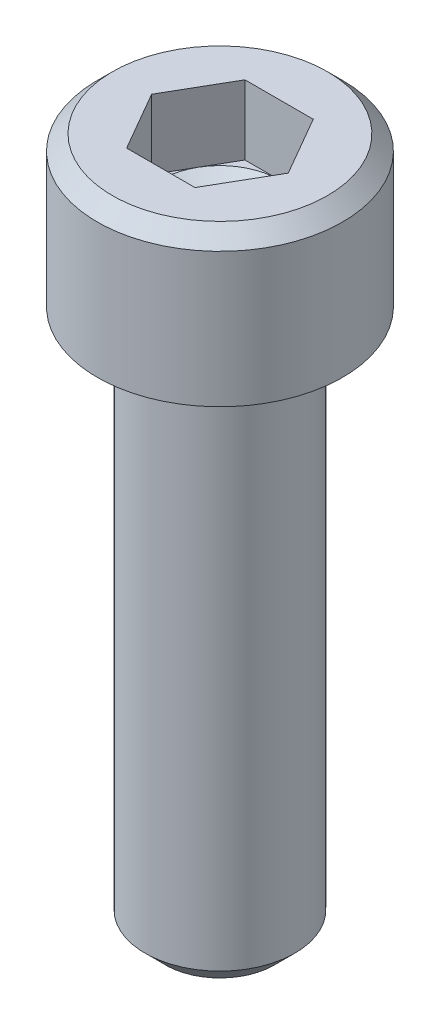
ISO-10303-21;
HEADER;
FILE_DESCRIPTION(('STEP AP214'),'2;1');
FILE_NAME('part.step','',(''),(''),'','','');
FILE_SCHEMA(('AUTOMOTIVE_DESIGN { 1 0 10303 214 1 1 1 1 }'));
ENDSEC;
DATA;
#1=APPLICATION_CONTEXT('core data for automotive mechanical design processes');
#2=APPLICATION_PROTOCOL_DEFINITION('international standard','automotive_design',2000,#1);
#3=PRODUCT_CONTEXT('',#1,'mechanical');
#4=PRODUCT('Part','Part','',(#3));
#5=PRODUCT_RELATED_PRODUCT_CATEGORY('part','',(#4));
#6=PRODUCT_DEFINITION_FORMATION('','',#4);
#7=PRODUCT_DEFINITION_CONTEXT('part definition',#1,'design');
#8=PRODUCT_DEFINITION('design','',#6,#7);
#9=PRODUCT_DEFINITION_SHAPE('','',#8);
#10=(LENGTH_UNIT() NAMED_UNIT(*) SI_UNIT(.MILLI.,.METRE.));
#11=(NAMED_UNIT(*) PLANE_ANGLE_UNIT() SI_UNIT($,.RADIAN.));
#12=(NAMED_UNIT(*) SI_UNIT($,.STERADIAN.) SOLID_ANGLE_UNIT());
#13=UNCERTAINTY_MEASURE_WITH_UNIT(LENGTH_MEASURE(1.E-05),#10,'distance_accuracy_value','');
#14=(GEOMETRIC_REPRESENTATION_CONTEXT(3) GLOBAL_UNCERTAINTY_ASSIGNED_CONTEXT((#13)) GLOBAL_UNIT_ASSIGNED_CONTEXT((#10,
#11,#12)) REPRESENTATION_CONTEXT('',''));
#15=CARTESIAN_POINT('',(0.,0.,0.));
#16=DIRECTION('',(0.,0.,1.));
#17=DIRECTION('',(1.,0.,0.));
#18=AXIS2_PLACEMENT_3D('',#15,#16,#17);
#19=CARTESIAN_POINT('',(0.,3.14960000010228,0.));
#20=DIRECTION('',(0.,-1.,0.));
#21=DIRECTION('',(0.,0.,-1.));
#22=AXIS2_PLACEMENT_3D('',#19,#20,#21);
#23=CONICAL_SURFACE('',#22,2.8702,0.785398163397447);
#24=CARTESIAN_POINT('',(0.,3.50520000002842,0.));
#25=DIRECTION('',(0.,-1.,0.));
#26=DIRECTION('',(0.,0.,-1.));
#27=AXIS2_PLACEMENT_3D('',#24,#25,#26);
#28=CIRCLE('',#27,2.51460000007386);
#29=CARTESIAN_POINT('',(0.,3.50520000002842,-2.51460000007386));
#30=VERTEX_POINT('',#29);
#31=EDGE_CURVE('E11',#30,#30,#28,.T.);
#32=ORIENTED_EDGE('',*,*,#31,.T.);
#33=EDGE_LOOP('',(#32));
#34=FACE_BOUND('',#33,.T.);
#35=CARTESIAN_POINT('',(0.,3.14960000010228,0.));
#36=DIRECTION('',(0.,-1.,0.));
#37=DIRECTION('',(0.,0.,-1.));
#38=AXIS2_PLACEMENT_3D('',#35,#36,#37);
#39=CIRCLE('',#38,2.8702);
#40=CARTESIAN_POINT('',(0.,3.14960000010228,-2.8702));
#41=VERTEX_POINT('',#40);
#42=EDGE_CURVE('E159',#41,#41,#39,.T.);
#43=ORIENTED_EDGE('',*,*,#42,.F.);
#44=EDGE_LOOP('',(#43));
#45=FACE_BOUND('',#44,.T.);
#46=ADVANCED_FACE('F33',(#34,#45),#23,.T.);
#47=CARTESIAN_POINT('',(2.51460000007386,3.50520000002842,0.));
#48=DIRECTION('',(0.,1.,0.));
#49=DIRECTION('',(0.,0.,1.));
#50=AXIS2_PLACEMENT_3D('',#47,#48,#49);
#51=PLANE('',#50);
#52=DIRECTION('',(-0.500000000000001,0.,-0.866025403784438));
#53=VECTOR('',#52,1.);
#54=CARTESIAN_POINT('',(1.5984519552784,3.50520000002842,0.));
#55=LINE('',#54,#53);
#56=CARTESIAN_POINT('',(1.5984519552784,3.50520000002842,0.));
#57=VERTEX_POINT('',#56);
#58=CARTESIAN_POINT('',(0.799225977639198,3.50520000002842,-1.3843));
#59=VERTEX_POINT('',#58);
#60=EDGE_CURVE('E154',#57,#59,#55,.T.);
#61=ORIENTED_EDGE('',*,*,#60,.F.);
#62=DIRECTION('',(0.500000000000003,0.,-0.866025403784437));
#63=VECTOR('',#62,1.);
#64=CARTESIAN_POINT('',(0.799225977639196,3.50520000002842,1.3843));
#65=LINE('',#64,#63);
#66=CARTESIAN_POINT('',(0.799225977639196,3.50520000002842,1.3843));
#67=VERTEX_POINT('',#66);
#68=EDGE_CURVE('E152',#67,#57,#65,.T.);
#69=ORIENTED_EDGE('',*,*,#68,.F.);
#70=DIRECTION('',(1.,0.,0.));
#71=VECTOR('',#70,1.);
#72=CARTESIAN_POINT('',(-0.799225977639201,3.50520000002842,1.3843));
#73=LINE('',#72,#71);
#74=CARTESIAN_POINT('',(-0.799225977639201,3.50520000002842,1.3843));
#75=VERTEX_POINT('',#74);
#76=EDGE_CURVE('E150',#75,#67,#73,.T.);
#77=ORIENTED_EDGE('',*,*,#76,.F.);
#78=DIRECTION('',(0.5,0.,0.866025403784439));
#79=VECTOR('',#78,1.);
#80=CARTESIAN_POINT('',(-1.5984519552784,3.50520000002842,0.));
#81=LINE('',#80,#79);
#82=CARTESIAN_POINT('',(-1.5984519552784,3.50520000002842,0.));
#83=VERTEX_POINT('',#82);
#84=EDGE_CURVE('E148',#83,#75,#81,.T.);
#85=ORIENTED_EDGE('',*,*,#84,.F.);
#86=DIRECTION('',(-0.500000000000001,0.,0.866025403784438));
#87=VECTOR('',#86,1.);
#88=CARTESIAN_POINT('',(-0.799225977639199,3.50520000002842,-1.3843));
#89=LINE('',#88,#87);
#90=CARTESIAN_POINT('',(-0.799225977639199,3.50520000002842,-1.3843));
#91=VERTEX_POINT('',#90);
#92=EDGE_CURVE('E121',#91,#83,#89,.T.);
#93=ORIENTED_EDGE('',*,*,#92,.F.);
#94=DIRECTION('',(-1.,0.,0.));
#95=VECTOR('',#94,1.);
#96=CARTESIAN_POINT('',(0.799225977639198,3.50520000002842,-1.3843));
#97=LINE('',#96,#95);
#98=EDGE_CURVE('E114',#59,#91,#97,.T.);
#99=ORIENTED_EDGE('',*,*,#98,.F.);
#100=EDGE_LOOP('',(#61,#69,#77,#85,#93,#99));
#101=FACE_BOUND('',#100,.T.);
#102=ORIENTED_EDGE('',*,*,#31,.F.);
#103=EDGE_LOOP('',(#102));
#104=FACE_BOUND('',#103,.T.);
#105=ADVANCED_FACE('F227',(#101,#104),#51,.T.);
#106=CARTESIAN_POINT('',(0.,-12.7,0.));
#107=DIRECTION('',(0.,-1.,0.));
#108=DIRECTION('',(0.,0.,-1.));
#109=AXIS2_PLACEMENT_3D('',#106,#107,#108);
#110=PLANE('',#109);
#111=CARTESIAN_POINT('',(0.,-12.7,0.));
#112=DIRECTION('',(0.,-1.,0.));
#113=DIRECTION('',(0.,0.,-1.));
#114=AXIS2_PLACEMENT_3D('',#111,#112,#113);
#115=CIRCLE('',#114,1.28016000001318);
#116=CARTESIAN_POINT('',(0.,-12.7,-1.28016000001318));
#117=VERTEX_POINT('',#116);
#118=EDGE_CURVE('E185',#117,#117,#115,.T.);
#119=ORIENTED_EDGE('',*,*,#118,.T.);
#120=EDGE_LOOP('',(#119));
#121=FACE_BOUND('',#120,.T.);
#122=ADVANCED_FACE('F244',(#121),#110,.T.);
#123=CARTESIAN_POINT('',(0.,-12.7,0.));
#124=DIRECTION('',(0.,1.,0.));
#125=DIRECTION('',(0.,0.,1.));
#126=AXIS2_PLACEMENT_3D('',#123,#124,#125);
#127=CONICAL_SURFACE('',#126,1.28016000001318,0.785398163397443);
#128=CARTESIAN_POINT('',(0.,-12.2275600000132,0.));
#129=DIRECTION('',(0.,-1.,0.));
#130=DIRECTION('',(0.,0.,-1.));
#131=AXIS2_PLACEMENT_3D('',#128,#129,#130);
#132=CIRCLE('',#131,1.7526);
#133=CARTESIAN_POINT('',(0.,-12.2275600000132,-1.7526));
#134=VERTEX_POINT('',#133);
#135=EDGE_CURVE('E182',#134,#134,#132,.T.);
#136=ORIENTED_EDGE('',*,*,#135,.T.);
#137=EDGE_LOOP('',(#136));
#138=FACE_BOUND('',#137,.T.);
#139=ORIENTED_EDGE('',*,*,#118,.F.);
#140=EDGE_LOOP('',(#139));
#141=FACE_BOUND('',#140,.T.);
#142=ADVANCED_FACE('F270',(#138,#141),#127,.T.);
#143=CARTESIAN_POINT('',(0.,3.50520000002842,0.));
#144=DIRECTION('',(0.,-1.,0.));
#145=DIRECTION('',(0.,0.,-1.));
#146=AXIS2_PLACEMENT_3D('',#143,#144,#145);
#147=CYLINDRICAL_SURFACE('',#146,1.7526);
#148=CARTESIAN_POINT('',(0.,-0.254000000000001,0.));
#149=DIRECTION('',(0.,-1.,0.));
#150=DIRECTION('',(0.,0.,-1.));
#151=AXIS2_PLACEMENT_3D('',#148,#149,#150);
#152=CIRCLE('',#151,1.7526);
#153=CARTESIAN_POINT('',(0.,-0.254000000000001,-1.7526));
#154=VERTEX_POINT('',#153);
#155=EDGE_CURVE('E179',#154,#154,#152,.T.);
#156=ORIENTED_EDGE('',*,*,#155,.T.);
#157=EDGE_LOOP('',(#156));
#158=FACE_BOUND('',#157,.T.);
#159=ORIENTED_EDGE('',*,*,#135,.F.);
#160=EDGE_LOOP('',(#159));
#161=FACE_BOUND('',#160,.T.);
#162=ADVANCED_FACE('F264',(#158,#161),#147,.T.);
#163=CARTESIAN_POINT('',(0.,-0.254000000000001,0.));
#164=DIRECTION('',(0.,-1.,0.));
#165=DIRECTION('',(0.,0.,-1.));
#166=AXIS2_PLACEMENT_3D('',#163,#164,#165);
#167=TOROIDAL_SURFACE('',#166,2.0066,0.254);
#168=CARTESIAN_POINT('',(0.,0.,0.));
#169=DIRECTION('',(0.,-1.,0.));
#170=DIRECTION('',(0.,0.,-1.));
#171=AXIS2_PLACEMENT_3D('',#168,#169,#170);
#172=CIRCLE('',#171,2.0066);
#173=CARTESIAN_POINT('',(0.,0.,-2.0066));
#174=VERTEX_POINT('',#173);
#175=EDGE_CURVE('E176',#174,#174,#172,.T.);
#176=ORIENTED_EDGE('',*,*,#175,.T.);
#177=EDGE_LOOP('',(#176));
#178=FACE_BOUND('',#177,.T.);
#179=ORIENTED_EDGE('',*,*,#155,.F.);
#180=EDGE_LOOP('',(#179));
#181=FACE_BOUND('',#180,.T.);
#182=ADVANCED_FACE('F258',(#178,#181),#167,.F.);
#183=CARTESIAN_POINT('',(2.0066,0.,0.));
#184=DIRECTION('',(0.,-1.,0.));
#185=DIRECTION('',(0.,0.,-1.));
#186=AXIS2_PLACEMENT_3D('',#183,#184,#185);
#187=PLANE('',#186);
#188=CARTESIAN_POINT('',(0.,0.,0.));
#189=DIRECTION('',(0.,-1.,0.));
#190=DIRECTION('',(0.,0.,-1.));
#191=AXIS2_PLACEMENT_3D('',#188,#189,#190);
#192=CIRCLE('',#191,2.8702);
#193=CARTESIAN_POINT('',(0.,0.,-2.8702));
#194=VERTEX_POINT('',#193);
#195=EDGE_CURVE('E173',#194,#194,#192,.T.);
#196=ORIENTED_EDGE('',*,*,#195,.T.);
#197=EDGE_LOOP('',(#196));
#198=FACE_BOUND('',#197,.T.);
#199=ORIENTED_EDGE('',*,*,#175,.F.);
#200=EDGE_LOOP('',(#199));
#201=FACE_BOUND('',#200,.T.);
#202=ADVANCED_FACE('F252',(#198,#201),#187,.T.);
#203=CARTESIAN_POINT('',(0.,3.50520000002842,0.));
#204=DIRECTION('',(0.,-1.,0.));
#205=DIRECTION('',(0.,0.,-1.));
#206=AXIS2_PLACEMENT_3D('',#203,#204,#205);
#207=CYLINDRICAL_SURFACE('',#206,2.8702);
#208=ORIENTED_EDGE('',*,*,#42,.T.);
#209=EDGE_LOOP('',(#208));
#210=FACE_BOUND('',#209,.T.);
#211=ORIENTED_EDGE('',*,*,#195,.F.);
#212=EDGE_LOOP('',(#211));
#213=FACE_BOUND('',#212,.T.);
#214=ADVANCED_FACE('F249',(#210,#213),#207,.T.);
#215=CARTESIAN_POINT('',(-0.799225977639199,1.87960000002842,-1.3843));
#216=DIRECTION('',(-0.866025403784438,0.,-0.500000000000001));
#217=DIRECTION('',(-0.500000000000001,0.,0.866025403784438));
#218=AXIS2_PLACEMENT_3D('',#215,#216,#217);
#219=PLANE('',#218);
#220=ORIENTED_EDGE('',*,*,#92,.T.);
#221=DIRECTION('',(0.,1.,0.));
#222=VECTOR('',#221,1.);
#223=CARTESIAN_POINT('',(-1.5984519552784,1.87960000002842,0.));
#224=LINE('',#223,#222);
#225=CARTESIAN_POINT('',(-1.5984519552784,1.87960000002842,0.));
#226=VERTEX_POINT('',#225);
#227=EDGE_CURVE('E117',#226,#83,#224,.T.);
#228=ORIENTED_EDGE('',*,*,#227,.F.);
#229=DIRECTION('',(-0.500000000000001,0.,0.866025403784438));
#230=VECTOR('',#229,1.);
#231=CARTESIAN_POINT('',(-0.799225977639199,1.87960000002842,-1.3843));
#232=LINE('',#231,#230);
#233=CARTESIAN_POINT('',(-1.1988389664588,1.87960000002842,-0.692150000000002));
#234=VERTEX_POINT('',#233);
#235=EDGE_CURVE('E103',#234,#226,#232,.T.);
#236=ORIENTED_EDGE('',*,*,#235,.F.);
#237=CARTESIAN_POINT('',(-0.799225977639199,1.87960000002842,-1.3843));
#238=VERTEX_POINT('',#237);
#239=EDGE_CURVE('E113',#238,#234,#232,.T.);
#240=ORIENTED_EDGE('',*,*,#239,.F.);
#241=DIRECTION('',(0.,1.,0.));
#242=VECTOR('',#241,1.);
#243=CARTESIAN_POINT('',(-0.799225977639199,1.87960000002842,-1.3843));
#244=LINE('',#243,#242);
#245=EDGE_CURVE('E157',#238,#91,#244,.T.);
#246=ORIENTED_EDGE('',*,*,#245,.T.);
#247=EDGE_LOOP('',(#220,#228,#236,#240,#246));
#248=FACE_BOUND('',#247,.T.);
#249=ADVANCED_FACE('F118',(#248),#219,.F.);
#250=CARTESIAN_POINT('',(0.799225977639198,1.87960000002842,-1.3843));
#251=DIRECTION('',(0.,0.,-1.));
#252=DIRECTION('',(-1.,0.,0.));
#253=AXIS2_PLACEMENT_3D('',#250,#251,#252);
#254=PLANE('',#253);
#255=ORIENTED_EDGE('',*,*,#98,.T.);
#256=ORIENTED_EDGE('',*,*,#245,.F.);
#257=DIRECTION('',(-1.,0.,0.));
#258=VECTOR('',#257,1.);
#259=CARTESIAN_POINT('',(0.799225977639198,1.87960000002842,-1.3843));
#260=LINE('',#259,#258);
#261=CARTESIAN_POINT('',(0.,1.87960000002842,-1.3843));
#262=VERTEX_POINT('',#261);
#263=EDGE_CURVE('E144',#262,#238,#260,.T.);
#264=ORIENTED_EDGE('',*,*,#263,.F.);
#265=CARTESIAN_POINT('',(0.799225977639198,1.87960000002842,-1.3843));
#266=VERTEX_POINT('',#265);
#267=EDGE_CURVE('E126',#266,#262,#260,.T.);
#268=ORIENTED_EDGE('',*,*,#267,.F.);
#269=DIRECTION('',(0.,1.,0.));
#270=VECTOR('',#269,1.);
#271=CARTESIAN_POINT('',(0.799225977639198,1.87960000002842,-1.3843));
#272=LINE('',#271,#270);
#273=EDGE_CURVE('E160',#266,#59,#272,.T.);
#274=ORIENTED_EDGE('',*,*,#273,.T.);
#275=EDGE_LOOP('',(#255,#256,#264,#268,#274));
#276=FACE_BOUND('',#275,.T.);
#277=ADVANCED_FACE('F222',(#276),#254,.F.);
#278=CARTESIAN_POINT('',(1.5984519552784,1.87960000002842,0.));
#279=DIRECTION('',(0.866025403784438,0.,-0.500000000000001));
#280=DIRECTION('',(-0.500000000000001,0.,-0.866025403784438));
#281=AXIS2_PLACEMENT_3D('',#278,#279,#280);
#282=PLANE('',#281);
#283=ORIENTED_EDGE('',*,*,#60,.T.);
#284=ORIENTED_EDGE('',*,*,#273,.F.);
#285=DIRECTION('',(-0.500000000000001,0.,-0.866025403784438));
#286=VECTOR('',#285,1.);
#287=CARTESIAN_POINT('',(1.5984519552784,1.87960000002842,0.));
#288=LINE('',#287,#286);
#289=CARTESIAN_POINT('',(1.1988389664588,1.87960000002842,-0.692150000000002));
#290=VERTEX_POINT('',#289);
#291=EDGE_CURVE('E140',#290,#266,#288,.T.);
#292=ORIENTED_EDGE('',*,*,#291,.F.);
#293=CARTESIAN_POINT('',(1.5984519552784,1.87960000002842,0.));
#294=VERTEX_POINT('',#293);
#295=EDGE_CURVE('E141',#294,#290,#288,.T.);
#296=ORIENTED_EDGE('',*,*,#295,.F.);
#297=DIRECTION('',(0.,1.,0.));
#298=VECTOR('',#297,1.);
#299=CARTESIAN_POINT('',(1.5984519552784,1.87960000002842,0.));
#300=LINE('',#299,#298);
#301=EDGE_CURVE('E163',#294,#57,#300,.T.);
#302=ORIENTED_EDGE('',*,*,#301,.T.);
#303=EDGE_LOOP('',(#283,#284,#292,#296,#302));
#304=FACE_BOUND('',#303,.T.);
#305=ADVANCED_FACE('F217',(#304),#282,.F.);
#306=CARTESIAN_POINT('',(0.799225977639196,1.87960000002842,1.3843));
#307=DIRECTION('',(0.866025403784437,0.,0.500000000000003));
#308=DIRECTION('',(0.500000000000003,0.,-0.866025403784437));
#309=AXIS2_PLACEMENT_3D('',#306,#307,#308);
#310=PLANE('',#309);
#311=ORIENTED_EDGE('',*,*,#68,.T.);
#312=ORIENTED_EDGE('',*,*,#301,.F.);
#313=DIRECTION('',(0.500000000000003,0.,-0.866025403784437));
#314=VECTOR('',#313,1.);
#315=CARTESIAN_POINT('',(0.799225977639196,1.87960000002842,1.3843));
#316=LINE('',#315,#314);
#317=CARTESIAN_POINT('',(1.1988389664588,1.87960000002842,0.692150000000004));
#318=VERTEX_POINT('',#317);
#319=EDGE_CURVE('E136',#318,#294,#316,.T.);
#320=ORIENTED_EDGE('',*,*,#319,.F.);
#321=CARTESIAN_POINT('',(0.799225977639196,1.87960000002842,1.3843));
#322=VERTEX_POINT('',#321);
#323=EDGE_CURVE('E137',#322,#318,#316,.T.);
#324=ORIENTED_EDGE('',*,*,#323,.F.);
#325=DIRECTION('',(0.,1.,0.));
#326=VECTOR('',#325,1.);
#327=CARTESIAN_POINT('',(0.799225977639196,1.87960000002842,1.3843));
#328=LINE('',#327,#326);
#329=EDGE_CURVE('E166',#322,#67,#328,.T.);
#330=ORIENTED_EDGE('',*,*,#329,.T.);
#331=EDGE_LOOP('',(#311,#312,#320,#324,#330));
#332=FACE_BOUND('',#331,.T.);
#333=ADVANCED_FACE('F213',(#332),#310,.F.);
#334=CARTESIAN_POINT('',(-0.799225977639201,1.87960000002842,1.3843));
#335=DIRECTION('',(0.,0.,1.));
#336=DIRECTION('',(1.,0.,0.));
#337=AXIS2_PLACEMENT_3D('',#334,#335,#336);
#338=PLANE('',#337);
#339=ORIENTED_EDGE('',*,*,#76,.T.);
#340=ORIENTED_EDGE('',*,*,#329,.F.);
#341=DIRECTION('',(1.,0.,0.));
#342=VECTOR('',#341,1.);
#343=CARTESIAN_POINT('',(-0.799225977639201,1.87960000002842,1.3843));
#344=LINE('',#343,#342);
#345=CARTESIAN_POINT('',(0.,1.87959999978283,1.38430000009762));
#346=VERTEX_POINT('',#345);
#347=EDGE_CURVE('E132',#346,#322,#344,.T.);
#348=ORIENTED_EDGE('',*,*,#347,.F.);
#349=CARTESIAN_POINT('',(-0.799225977639201,1.87960000002842,1.3843));
#350=VERTEX_POINT('',#349);
#351=EDGE_CURVE('E47',#350,#346,#344,.T.);
#352=ORIENTED_EDGE('',*,*,#351,.F.);
#353=DIRECTION('',(0.,1.,0.));
#354=VECTOR('',#353,1.);
#355=CARTESIAN_POINT('',(-0.799225977639201,1.87960000002842,1.3843));
#356=LINE('',#355,#354);
#357=EDGE_CURVE('E125',#350,#75,#356,.T.);
#358=ORIENTED_EDGE('',*,*,#357,.T.);
#359=EDGE_LOOP('',(#339,#340,#348,#352,#358));
#360=FACE_BOUND('',#359,.T.);
#361=ADVANCED_FACE('F230',(#360),#338,.F.);
#362=CARTESIAN_POINT('',(-1.5984519552784,1.87960000002842,0.));
#363=DIRECTION('',(-0.866025403784439,0.,0.5));
#364=DIRECTION('',(0.5,0.,0.866025403784439));
#365=AXIS2_PLACEMENT_3D('',#362,#363,#364);
#366=PLANE('',#365);
#367=ORIENTED_EDGE('',*,*,#84,.T.);
#368=ORIENTED_EDGE('',*,*,#357,.F.);
#369=DIRECTION('',(0.5,0.,0.866025403784439));
#370=VECTOR('',#369,1.);
#371=CARTESIAN_POINT('',(-1.5984519552784,1.87960000002842,0.));
#372=LINE('',#371,#370);
#373=CARTESIAN_POINT('',(-1.1988389664588,1.87960000002842,0.69215));
#374=VERTEX_POINT('',#373);
#375=EDGE_CURVE('E131',#374,#350,#372,.T.);
#376=ORIENTED_EDGE('',*,*,#375,.F.);
#377=EDGE_CURVE('E107',#226,#374,#372,.T.);
#378=ORIENTED_EDGE('',*,*,#377,.F.);
#379=ORIENTED_EDGE('',*,*,#227,.T.);
#380=EDGE_LOOP('',(#367,#368,#376,#378,#379));
#381=FACE_BOUND('',#380,.T.);
#382=ADVANCED_FACE('F129',(#381),#366,.F.);
#383=CARTESIAN_POINT('',(0.,1.87960000002842,0.));
#384=DIRECTION('',(0.,1.,0.));
#385=DIRECTION('',(0.,0.,1.));
#386=AXIS2_PLACEMENT_3D('',#383,#384,#385);
#387=PLANE('',#386);
#388=ORIENTED_EDGE('',*,*,#347,.T.);
#389=ORIENTED_EDGE('',*,*,#323,.T.);
#390=CARTESIAN_POINT('',(0.,1.87959999978283,0.));
#391=DIRECTION('',(0.,-1.,0.));
#392=DIRECTION('',(0.,0.,-1.));
#393=AXIS2_PLACEMENT_3D('',#390,#391,#392);
#394=CIRCLE('',#393,1.38430000009762);
#395=EDGE_CURVE('E192',#318,#346,#394,.T.);
#396=ORIENTED_EDGE('',*,*,#395,.T.);
#397=EDGE_LOOP('',(#388,#389,#396));
#398=FACE_BOUND('',#397,.T.);
#399=ADVANCED_FACE('F201',(#398),#387,.T.);
#400=ORIENTED_EDGE('',*,*,#319,.T.);
#401=ORIENTED_EDGE('',*,*,#295,.T.);
#402=EDGE_CURVE('E188',#290,#318,#394,.T.);
#403=ORIENTED_EDGE('',*,*,#402,.T.);
#404=EDGE_LOOP('',(#400,#401,#403));
#405=FACE_BOUND('',#404,.T.);
#406=ADVANCED_FACE('F209',(#405),#387,.T.);
#407=ORIENTED_EDGE('',*,*,#291,.T.);
#408=ORIENTED_EDGE('',*,*,#267,.T.);
#409=EDGE_CURVE('E40',#262,#290,#394,.T.);
#410=ORIENTED_EDGE('',*,*,#409,.T.);
#411=EDGE_LOOP('',(#407,#408,#410));
#412=FACE_BOUND('',#411,.T.);
#413=ADVANCED_FACE('F220',(#412),#387,.T.);
#414=ORIENTED_EDGE('',*,*,#263,.T.);
#415=ORIENTED_EDGE('',*,*,#239,.T.);
#416=EDGE_CURVE('E187',#234,#262,#394,.T.);
#417=ORIENTED_EDGE('',*,*,#416,.T.);
#418=EDGE_LOOP('',(#414,#415,#417));
#419=FACE_BOUND('',#418,.T.);
#420=ADVANCED_FACE('F225',(#419),#387,.T.);
#421=ORIENTED_EDGE('',*,*,#235,.T.);
#422=ORIENTED_EDGE('',*,*,#377,.T.);
#423=EDGE_CURVE('E109',#374,#234,#394,.T.);
#424=ORIENTED_EDGE('',*,*,#423,.T.);
#425=EDGE_LOOP('',(#421,#422,#424));
#426=FACE_BOUND('',#425,.T.);
#427=ADVANCED_FACE('F105',(#426),#387,.T.);
#428=ORIENTED_EDGE('',*,*,#375,.T.);
#429=ORIENTED_EDGE('',*,*,#351,.T.);
#430=EDGE_CURVE('E196',#346,#374,#394,.T.);
#431=ORIENTED_EDGE('',*,*,#430,.T.);
#432=EDGE_LOOP('',(#428,#429,#431));
#433=FACE_BOUND('',#432,.T.);
#434=ADVANCED_FACE('F285',(#433),#387,.T.);
#435=CARTESIAN_POINT('',(0.,1.87959999978283,0.));
#436=DIRECTION('',(0.,1.,0.));
#437=DIRECTION('',(0.,0.,1.));
#438=AXIS2_PLACEMENT_3D('',#435,#436,#437);
#439=CONICAL_SURFACE('',#438,1.38430000009762,1.0471975511966);
#440=CARTESIAN_POINT('',(0.,1.08037402208727,0.));
#441=VERTEX_POINT('',#440);
#442=VERTEX_LOOP('',#441);
#443=FACE_BOUND('',#442,.T.);
#444=ORIENTED_EDGE('',*,*,#409,.F.);
#445=ORIENTED_EDGE('',*,*,#416,.F.);
#446=ORIENTED_EDGE('',*,*,#423,.F.);
#447=ORIENTED_EDGE('',*,*,#430,.F.);
#448=ORIENTED_EDGE('',*,*,#395,.F.);
#449=ORIENTED_EDGE('',*,*,#402,.F.);
#450=EDGE_LOOP('',(#444,#445,#446,#447,#448,#449));
#451=FACE_BOUND('',#450,.T.);
#452=ADVANCED_FACE('F206',(#443,#451),#439,.F.);
#453=CLOSED_SHELL('',(#46,#105,#122,#142,#162,#182,#202,#214,#249,#277,#305,#333,#361,#382,#399,
#406,#413,#420,#427,#434,#452));
#454=MANIFOLD_SOLID_BREP('B2',#453);
#455=ADVANCED_BREP_SHAPE_REPRESENTATION('',(#18,#454),#14);
#456=SHAPE_DEFINITION_REPRESENTATION(#9,#455);
ENDSEC;
END-ISO-10303-21;
